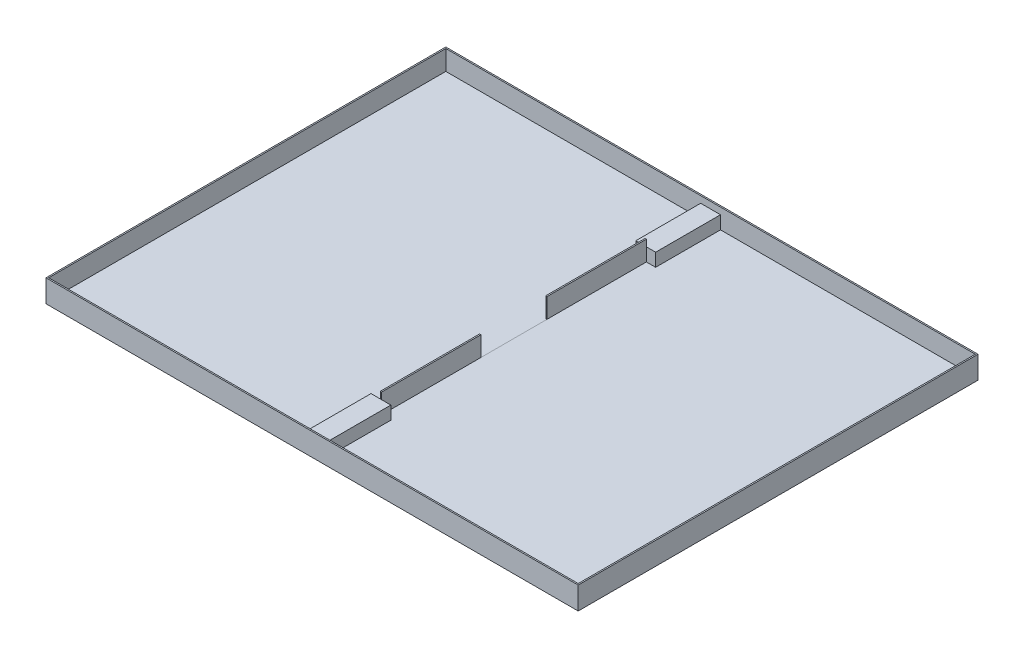
ISO-10303-21;
HEADER;
FILE_DESCRIPTION(('STEP AP214'),'2;1');
FILE_NAME('part.step','',(''),(''),'','','');
FILE_SCHEMA(('AUTOMOTIVE_DESIGN { 1 0 10303 214 1 1 1 1 }'));
ENDSEC;
DATA;
#1=APPLICATION_CONTEXT('core data for automotive mechanical design processes');
#2=APPLICATION_PROTOCOL_DEFINITION('international standard','automotive_design',2000,#1);
#3=PRODUCT_CONTEXT('',#1,'mechanical');
#4=PRODUCT('Part','Part','',(#3));
#5=PRODUCT_RELATED_PRODUCT_CATEGORY('part','',(#4));
#6=PRODUCT_DEFINITION_FORMATION('','',#4);
#7=PRODUCT_DEFINITION_CONTEXT('part definition',#1,'design');
#8=PRODUCT_DEFINITION('design','',#6,#7);
#9=PRODUCT_DEFINITION_SHAPE('','',#8);
#10=(LENGTH_UNIT() NAMED_UNIT(*) SI_UNIT(.MILLI.,.METRE.));
#11=(NAMED_UNIT(*) PLANE_ANGLE_UNIT() SI_UNIT($,.RADIAN.));
#12=(NAMED_UNIT(*) SI_UNIT($,.STERADIAN.) SOLID_ANGLE_UNIT());
#13=UNCERTAINTY_MEASURE_WITH_UNIT(LENGTH_MEASURE(1.E-05),#10,'distance_accuracy_value','');
#14=(GEOMETRIC_REPRESENTATION_CONTEXT(3) GLOBAL_UNCERTAINTY_ASSIGNED_CONTEXT((#13)) GLOBAL_UNIT_ASSIGNED_CONTEXT((#10,
#11,#12)) REPRESENTATION_CONTEXT('',''));
#15=CARTESIAN_POINT('',(0.,0.,0.));
#16=DIRECTION('',(0.,0.,1.));
#17=DIRECTION('',(1.,0.,0.));
#18=AXIS2_PLACEMENT_3D('',#15,#16,#17);
#19=CARTESIAN_POINT('',(3179.75343521253,-132.123275580284,3020.));
#20=DIRECTION('',(0.,-1.,0.));
#21=DIRECTION('',(0.,0.,-1.));
#22=AXIS2_PLACEMENT_3D('',#19,#20,#21);
#23=PLANE('',#22);
#24=DIRECTION('',(0.,0.,1.));
#25=VECTOR('',#24,1.);
#26=CARTESIAN_POINT('',(1174.75343521253,-132.123275580284,10.0000000000002));
#27=LINE('',#26,#25);
#28=CARTESIAN_POINT('',(1174.75343521253,-132.123275580284,1250.));
#29=VERTEX_POINT('',#28);
#30=CARTESIAN_POINT('',(1174.75343521253,-132.123275580284,1750.));
#31=VERTEX_POINT('',#30);
#32=EDGE_CURVE('E302',#29,#31,#27,.T.);
#33=ORIENTED_EDGE('',*,*,#32,.F.);
#34=DIRECTION('',(1.,0.,0.));
#35=VECTOR('',#34,1.);
#36=CARTESIAN_POINT('',(0.,-132.123275580284,1250.));
#37=LINE('',#36,#35);
#38=CARTESIAN_POINT('',(1164.75343521253,-132.123275580284,1250.));
#39=VERTEX_POINT('',#38);
#40=EDGE_CURVE('E409',#39,#29,#37,.T.);
#41=ORIENTED_EDGE('',*,*,#40,.F.);
#42=DIRECTION('',(0.,0.,1.));
#43=VECTOR('',#42,1.);
#44=CARTESIAN_POINT('',(1164.75343521253,-132.123275580284,0.));
#45=LINE('',#44,#43);
#46=CARTESIAN_POINT('',(1164.75343521253,-132.123275580284,500.));
#47=VERTEX_POINT('',#46);
#48=EDGE_CURVE('E404',#47,#39,#45,.T.);
#49=ORIENTED_EDGE('',*,*,#48,.F.);
#50=DIRECTION('',(1.,0.,0.));
#51=VECTOR('',#50,1.);
#52=CARTESIAN_POINT('',(1094.75343521253,-132.123275580284,500.));
#53=LINE('',#52,#51);
#54=CARTESIAN_POINT('',(1094.75343521253,-132.123275580284,500.));
#55=VERTEX_POINT('',#54);
#56=EDGE_CURVE('E338',#55,#47,#53,.T.);
#57=ORIENTED_EDGE('',*,*,#56,.F.);
#58=DIRECTION('',(0.,0.,1.));
#59=VECTOR('',#58,1.);
#60=CARTESIAN_POINT('',(1094.75343521253,-132.123275580284,10.));
#61=LINE('',#60,#59);
#62=CARTESIAN_POINT('',(1094.75343521253,-132.123275580284,10.));
#63=VERTEX_POINT('',#62);
#64=EDGE_CURVE('E274',#63,#55,#61,.T.);
#65=ORIENTED_EDGE('',*,*,#64,.F.);
#66=DIRECTION('',(1.,0.,0.));
#67=VECTOR('',#66,1.);
#68=CARTESIAN_POINT('',(0.,-132.123275580284,10.));
#69=LINE('',#68,#67);
#70=CARTESIAN_POINT('',(-830.246564787466,-132.123275580284,10.));
#71=VERTEX_POINT('',#70);
#72=EDGE_CURVE('E390',#71,#63,#69,.T.);
#73=ORIENTED_EDGE('',*,*,#72,.F.);
#74=DIRECTION('',(0.,0.,1.));
#75=VECTOR('',#74,1.);
#76=CARTESIAN_POINT('',(-830.246564787466,-132.123275580284,2.15077065546697E-13));
#77=LINE('',#76,#75);
#78=CARTESIAN_POINT('',(-830.246564787466,-132.123275580284,3010.));
#79=VERTEX_POINT('',#78);
#80=EDGE_CURVE('E362',#71,#79,#77,.T.);
#81=ORIENTED_EDGE('',*,*,#80,.T.);
#82=DIRECTION('',(1.,0.,0.));
#83=VECTOR('',#82,1.);
#84=CARTESIAN_POINT('',(0.,-132.123275580284,3010.));
#85=LINE('',#84,#83);
#86=CARTESIAN_POINT('',(1094.75343521253,-132.123275580284,3010.));
#87=VERTEX_POINT('',#86);
#88=EDGE_CURVE('E367',#79,#87,#85,.T.);
#89=ORIENTED_EDGE('',*,*,#88,.T.);
#90=DIRECTION('',(0.,0.,1.));
#91=VECTOR('',#90,1.);
#92=CARTESIAN_POINT('',(1094.75343521253,-132.123275580284,2500.));
#93=LINE('',#92,#91);
#94=CARTESIAN_POINT('',(1094.75343521253,-132.123275580284,2500.));
#95=VERTEX_POINT('',#94);
#96=EDGE_CURVE('E316',#95,#87,#93,.T.);
#97=ORIENTED_EDGE('',*,*,#96,.F.);
#98=DIRECTION('',(-1.,0.,0.));
#99=VECTOR('',#98,1.);
#100=CARTESIAN_POINT('',(1094.75343521253,-132.123275580284,2500.));
#101=LINE('',#100,#99);
#102=CARTESIAN_POINT('',(1164.75343521253,-132.123275580284,2500.));
#103=VERTEX_POINT('',#102);
#104=EDGE_CURVE('E312',#103,#95,#101,.T.);
#105=ORIENTED_EDGE('',*,*,#104,.F.);
#106=DIRECTION('',(0.,0.,1.));
#107=VECTOR('',#106,1.);
#108=CARTESIAN_POINT('',(1164.75343521253,-132.123275580284,0.));
#109=LINE('',#108,#107);
#110=CARTESIAN_POINT('',(1164.75343521253,-132.123275580284,1750.));
#111=VERTEX_POINT('',#110);
#112=EDGE_CURVE('E435',#111,#103,#109,.T.);
#113=ORIENTED_EDGE('',*,*,#112,.F.);
#114=DIRECTION('',(1.,0.,0.));
#115=VECTOR('',#114,1.);
#116=CARTESIAN_POINT('',(0.,-132.123275580284,1750.));
#117=LINE('',#116,#115);
#118=EDGE_CURVE('E430',#111,#31,#117,.T.);
#119=ORIENTED_EDGE('',*,*,#118,.T.);
#120=EDGE_LOOP('',(#33,#41,#49,#57,#65,#73,#81,#89,#97,#105,#113,#119));
#121=FACE_BOUND('',#120,.T.);
#122=ADVANCED_FACE('F84',(#121),#23,.F.);
#123=CARTESIAN_POINT('',(0.,17.8767244197162,3010.));
#124=DIRECTION('',(0.,0.,-1.));
#125=DIRECTION('',(-1.,0.,0.));
#126=AXIS2_PLACEMENT_3D('',#123,#124,#125);
#127=PLANE('',#126);
#128=DIRECTION('',(0.,-1.,0.));
#129=VECTOR('',#128,1.);
#130=CARTESIAN_POINT('',(3169.75343521253,17.8767244197165,3010.));
#131=LINE('',#130,#129);
#132=CARTESIAN_POINT('',(3169.75343521253,17.8767244197165,3010.));
#133=VERTEX_POINT('',#132);
#134=CARTESIAN_POINT('',(3169.75343521253,-131.123275580283,3010.));
#135=VERTEX_POINT('',#134);
#136=EDGE_CURVE('E396',#133,#135,#131,.T.);
#137=ORIENTED_EDGE('',*,*,#136,.T.);
#138=DIRECTION('',(1.,0.,0.));
#139=VECTOR('',#138,1.);
#140=CARTESIAN_POINT('',(3169.75343521253,-131.123275580283,3010.));
#141=LINE('',#140,#139);
#142=CARTESIAN_POINT('',(1244.75343521253,-131.123275580284,3010.));
#143=VERTEX_POINT('',#142);
#144=EDGE_CURVE('E285',#143,#135,#141,.T.);
#145=ORIENTED_EDGE('',*,*,#144,.F.);
#146=DIRECTION('',(0.,-1.,0.));
#147=VECTOR('',#146,1.);
#148=CARTESIAN_POINT('',(1244.75343521253,-32.1232755802837,3010.));
#149=LINE('',#148,#147);
#150=CARTESIAN_POINT('',(1244.75343521253,-32.1232755802837,3010.));
#151=VERTEX_POINT('',#150);
#152=EDGE_CURVE('E281',#151,#143,#149,.T.);
#153=ORIENTED_EDGE('',*,*,#152,.F.);
#154=DIRECTION('',(1.,0.,0.));
#155=VECTOR('',#154,1.);
#156=CARTESIAN_POINT('',(1094.75343521253,-32.1232755802837,3010.));
#157=LINE('',#156,#155);
#158=CARTESIAN_POINT('',(1094.75343521253,-32.1232755802837,3010.));
#159=VERTEX_POINT('',#158);
#160=EDGE_CURVE('E322',#159,#151,#157,.T.);
#161=ORIENTED_EDGE('',*,*,#160,.F.);
#162=DIRECTION('',(0.,-1.,0.));
#163=VECTOR('',#162,1.);
#164=CARTESIAN_POINT('',(1094.75343521253,-32.1232755802837,3010.));
#165=LINE('',#164,#163);
#166=EDGE_CURVE('E330',#159,#87,#165,.T.);
#167=ORIENTED_EDGE('',*,*,#166,.T.);
#168=ORIENTED_EDGE('',*,*,#88,.F.);
#169=DIRECTION('',(0.,-1.,0.));
#170=VECTOR('',#169,1.);
#171=CARTESIAN_POINT('',(-830.246564787466,17.8767244197161,3010.));
#172=LINE('',#171,#170);
#173=CARTESIAN_POINT('',(-830.246564787466,17.8767244197161,3010.));
#174=VERTEX_POINT('',#173);
#175=EDGE_CURVE('E387',#174,#79,#172,.T.);
#176=ORIENTED_EDGE('',*,*,#175,.F.);
#177=DIRECTION('',(1.,0.,0.));
#178=VECTOR('',#177,1.);
#179=CARTESIAN_POINT('',(0.,17.8767244197162,3010.));
#180=LINE('',#179,#178);
#181=EDGE_CURVE('E384',#174,#133,#180,.T.);
#182=ORIENTED_EDGE('',*,*,#181,.T.);
#183=EDGE_LOOP('',(#137,#145,#153,#161,#167,#168,#176,#182));
#184=FACE_BOUND('',#183,.T.);
#185=ADVANCED_FACE('F506',(#184),#127,.T.);
#186=CARTESIAN_POINT('',(0.,17.8767244197162,10.));
#187=DIRECTION('',(0.,0.,-1.));
#188=DIRECTION('',(-1.,0.,0.));
#189=AXIS2_PLACEMENT_3D('',#186,#187,#188);
#190=PLANE('',#189);
#191=DIRECTION('',(-1.,0.,0.));
#192=VECTOR('',#191,1.);
#193=CARTESIAN_POINT('',(3169.75343521253,-131.123275580283,10.));
#194=LINE('',#193,#192);
#195=CARTESIAN_POINT('',(3169.75343521253,-131.123275580283,10.));
#196=VERTEX_POINT('',#195);
#197=CARTESIAN_POINT('',(1244.75343521253,-131.123275580284,10.));
#198=VERTEX_POINT('',#197);
#199=EDGE_CURVE('E293',#196,#198,#194,.T.);
#200=ORIENTED_EDGE('',*,*,#199,.F.);
#201=DIRECTION('',(0.,-1.,0.));
#202=VECTOR('',#201,1.);
#203=CARTESIAN_POINT('',(3169.75343521253,17.8767244197165,10.));
#204=LINE('',#203,#202);
#205=CARTESIAN_POINT('',(3169.75343521253,17.8767244197165,10.));
#206=VERTEX_POINT('',#205);
#207=EDGE_CURVE('E399',#206,#196,#204,.T.);
#208=ORIENTED_EDGE('',*,*,#207,.F.);
#209=DIRECTION('',(1.,0.,0.));
#210=VECTOR('',#209,1.);
#211=CARTESIAN_POINT('',(0.,17.8767244197162,10.));
#212=LINE('',#211,#210);
#213=CARTESIAN_POINT('',(-830.246564787466,17.8767244197161,10.));
#214=VERTEX_POINT('',#213);
#215=EDGE_CURVE('E379',#214,#206,#212,.T.);
#216=ORIENTED_EDGE('',*,*,#215,.F.);
#217=DIRECTION('',(0.,-1.,0.));
#218=VECTOR('',#217,1.);
#219=CARTESIAN_POINT('',(-830.246564787466,17.8767244197161,10.));
#220=LINE('',#219,#218);
#221=EDGE_CURVE('E402',#214,#71,#220,.T.);
#222=ORIENTED_EDGE('',*,*,#221,.T.);
#223=ORIENTED_EDGE('',*,*,#72,.T.);
#224=DIRECTION('',(0.,-1.,0.));
#225=VECTOR('',#224,1.);
#226=CARTESIAN_POINT('',(1094.75343521253,-32.1232755802837,10.));
#227=LINE('',#226,#225);
#228=CARTESIAN_POINT('',(1094.75343521253,-32.1232755802837,10.));
#229=VERTEX_POINT('',#228);
#230=EDGE_CURVE('E355',#229,#63,#227,.T.);
#231=ORIENTED_EDGE('',*,*,#230,.F.);
#232=DIRECTION('',(-1.,0.,0.));
#233=VECTOR('',#232,1.);
#234=CARTESIAN_POINT('',(1094.75343521253,-32.1232755802837,10.));
#235=LINE('',#234,#233);
#236=CARTESIAN_POINT('',(1244.75343521253,-32.1232755802837,10.));
#237=VERTEX_POINT('',#236);
#238=EDGE_CURVE('E337',#237,#229,#235,.T.);
#239=ORIENTED_EDGE('',*,*,#238,.F.);
#240=DIRECTION('',(0.,-1.,0.));
#241=VECTOR('',#240,1.);
#242=CARTESIAN_POINT('',(1244.75343521253,-32.1232755802837,10.));
#243=LINE('',#242,#241);
#244=EDGE_CURVE('E357',#237,#198,#243,.T.);
#245=ORIENTED_EDGE('',*,*,#244,.T.);
#246=EDGE_LOOP('',(#200,#208,#216,#222,#223,#231,#239,#245));
#247=FACE_BOUND('',#246,.T.);
#248=ADVANCED_FACE('F511',(#247),#190,.F.);
#249=CARTESIAN_POINT('',(1174.75343521253,17.8767244197163,0.));
#250=DIRECTION('',(1.,0.,0.));
#251=DIRECTION('',(0.,1.,0.));
#252=AXIS2_PLACEMENT_3D('',#249,#250,#251);
#253=PLANE('',#252);
#254=DIRECTION('',(0.,-1.,0.));
#255=VECTOR('',#254,1.);
#256=CARTESIAN_POINT('',(1174.75343521253,17.8767244197163,2500.));
#257=LINE('',#256,#255);
#258=CARTESIAN_POINT('',(1174.75343521253,-32.1232755802837,2500.));
#259=VERTEX_POINT('',#258);
#260=CARTESIAN_POINT('',(1174.75343521253,-131.123275580284,2500.));
#261=VERTEX_POINT('',#260);
#262=EDGE_CURVE('E442',#259,#261,#257,.T.);
#263=ORIENTED_EDGE('',*,*,#262,.T.);
#264=DIRECTION('',(0.,0.,1.));
#265=VECTOR('',#264,1.);
#266=CARTESIAN_POINT('',(1174.75343521253,-131.123275580284,10.0000000000002));
#267=LINE('',#266,#265);
#268=CARTESIAN_POINT('',(1174.75343521253,-131.123275580284,1750.));
#269=VERTEX_POINT('',#268);
#270=EDGE_CURVE('E99',#269,#261,#267,.T.);
#271=ORIENTED_EDGE('',*,*,#270,.F.);
#272=DIRECTION('',(0.,-1.,0.));
#273=VECTOR('',#272,1.);
#274=CARTESIAN_POINT('',(1174.75343521253,17.8767244197163,1750.));
#275=LINE('',#274,#273);
#276=CARTESIAN_POINT('',(1174.75343521253,17.8767244197163,1750.));
#277=VERTEX_POINT('',#276);
#278=EDGE_CURVE('E457',#277,#269,#275,.T.);
#279=ORIENTED_EDGE('',*,*,#278,.F.);
#280=DIRECTION('',(0.,0.,1.));
#281=VECTOR('',#280,1.);
#282=CARTESIAN_POINT('',(1174.75343521253,17.8767244197163,0.));
#283=LINE('',#282,#281);
#284=CARTESIAN_POINT('',(1174.75343521253,17.8767244197163,2500.));
#285=VERTEX_POINT('',#284);
#286=EDGE_CURVE('E431',#277,#285,#283,.T.);
#287=ORIENTED_EDGE('',*,*,#286,.T.);
#288=EDGE_CURVE('E447',#285,#259,#257,.T.);
#289=ORIENTED_EDGE('',*,*,#288,.T.);
#290=EDGE_LOOP('',(#263,#271,#279,#287,#289));
#291=FACE_BOUND('',#290,.T.);
#292=ADVANCED_FACE('F527',(#291),#253,.T.);
#293=CARTESIAN_POINT('',(1174.75343521253,17.8767244197163,0.));
#294=DIRECTION('',(1.,0.,0.));
#295=DIRECTION('',(0.,1.,0.));
#296=AXIS2_PLACEMENT_3D('',#293,#294,#295);
#297=PLANE('',#296);
#298=DIRECTION('',(0.,-1.,0.));
#299=VECTOR('',#298,1.);
#300=CARTESIAN_POINT('',(1174.75343521253,17.8767244197163,1250.));
#301=LINE('',#300,#299);
#302=CARTESIAN_POINT('',(1174.75343521253,17.8767244197163,1250.));
#303=VERTEX_POINT('',#302);
#304=CARTESIAN_POINT('',(1174.75343521253,-131.123275580284,1250.));
#305=VERTEX_POINT('',#304);
#306=EDGE_CURVE('E422',#303,#305,#301,.T.);
#307=ORIENTED_EDGE('',*,*,#306,.T.);
#308=CARTESIAN_POINT('',(1174.75343521253,-131.123275580284,500.));
#309=VERTEX_POINT('',#308);
#310=EDGE_CURVE('E295',#309,#305,#267,.T.);
#311=ORIENTED_EDGE('',*,*,#310,.F.);
#312=DIRECTION('',(0.,-1.,0.));
#313=VECTOR('',#312,1.);
#314=CARTESIAN_POINT('',(1174.75343521253,17.8767244197163,500.));
#315=LINE('',#314,#313);
#316=CARTESIAN_POINT('',(1174.75343521253,-32.1232755802837,500.));
#317=VERTEX_POINT('',#316);
#318=EDGE_CURVE('E416',#317,#309,#315,.T.);
#319=ORIENTED_EDGE('',*,*,#318,.F.);
#320=CARTESIAN_POINT('',(1174.75343521253,17.8767244197163,500.));
#321=VERTEX_POINT('',#320);
#322=EDGE_CURVE('E419',#321,#317,#315,.T.);
#323=ORIENTED_EDGE('',*,*,#322,.F.);
#324=DIRECTION('',(0.,0.,1.));
#325=VECTOR('',#324,1.);
#326=CARTESIAN_POINT('',(1174.75343521253,17.8767244197163,0.));
#327=LINE('',#326,#325);
#328=EDGE_CURVE('E413',#321,#303,#327,.T.);
#329=ORIENTED_EDGE('',*,*,#328,.T.);
#330=EDGE_LOOP('',(#307,#311,#319,#323,#329));
#331=FACE_BOUND('',#330,.T.);
#332=ADVANCED_FACE('F566',(#331),#297,.T.);
#333=CARTESIAN_POINT('',(3169.75343521253,17.8767244197165,-4.69217766154352E-13));
#334=DIRECTION('',(1.,0.,0.));
#335=DIRECTION('',(0.,0.,-1.));
#336=AXIS2_PLACEMENT_3D('',#333,#334,#335);
#337=PLANE('',#336);
#338=DIRECTION('',(0.,0.,-1.));
#339=VECTOR('',#338,1.);
#340=CARTESIAN_POINT('',(3169.75343521253,-131.123275580283,10.));
#341=LINE('',#340,#339);
#342=EDGE_CURVE('E296',#135,#196,#341,.T.);
#343=ORIENTED_EDGE('',*,*,#342,.F.);
#344=ORIENTED_EDGE('',*,*,#136,.F.);
#345=DIRECTION('',(0.,0.,1.));
#346=VECTOR('',#345,1.);
#347=CARTESIAN_POINT('',(3169.75343521253,17.8767244197165,-4.69217766154352E-13));
#348=LINE('',#347,#346);
#349=EDGE_CURVE('E382',#206,#133,#348,.T.);
#350=ORIENTED_EDGE('',*,*,#349,.F.);
#351=ORIENTED_EDGE('',*,*,#207,.T.);
#352=EDGE_LOOP('',(#343,#344,#350,#351));
#353=FACE_BOUND('',#352,.T.);
#354=ADVANCED_FACE('F545',(#353),#337,.F.);
#355=CARTESIAN_POINT('',(1244.75343521253,-32.1232755802837,10.));
#356=DIRECTION('',(-1.,0.,0.));
#357=DIRECTION('',(0.,-1.,0.));
#358=AXIS2_PLACEMENT_3D('',#355,#356,#357);
#359=PLANE('',#358);
#360=DIRECTION('',(0.,0.,1.));
#361=VECTOR('',#360,1.);
#362=CARTESIAN_POINT('',(1244.75343521253,-131.123275580284,10.));
#363=LINE('',#362,#361);
#364=CARTESIAN_POINT('',(1244.75343521253,-131.123275580284,500.));
#365=VERTEX_POINT('',#364);
#366=EDGE_CURVE('E306',#198,#365,#363,.T.);
#367=ORIENTED_EDGE('',*,*,#366,.F.);
#368=ORIENTED_EDGE('',*,*,#244,.F.);
#369=DIRECTION('',(0.,0.,-1.));
#370=VECTOR('',#369,1.);
#371=CARTESIAN_POINT('',(1244.75343521253,-32.1232755802837,10.));
#372=LINE('',#371,#370);
#373=CARTESIAN_POINT('',(1244.75343521253,-32.1232755802837,500.));
#374=VERTEX_POINT('',#373);
#375=EDGE_CURVE('E334',#374,#237,#372,.T.);
#376=ORIENTED_EDGE('',*,*,#375,.F.);
#377=DIRECTION('',(0.,-1.,0.));
#378=VECTOR('',#377,1.);
#379=CARTESIAN_POINT('',(1244.75343521253,-32.1232755802837,500.));
#380=LINE('',#379,#378);
#381=EDGE_CURVE('E346',#374,#365,#380,.T.);
#382=ORIENTED_EDGE('',*,*,#381,.T.);
#383=EDGE_LOOP('',(#367,#368,#376,#382));
#384=FACE_BOUND('',#383,.T.);
#385=ADVANCED_FACE('F554',(#384),#359,.F.);
#386=CARTESIAN_POINT('',(1094.75343521253,-32.1232755802837,500.));
#387=DIRECTION('',(0.,0.,-1.));
#388=DIRECTION('',(-1.,0.,0.));
#389=AXIS2_PLACEMENT_3D('',#386,#387,#388);
#390=PLANE('',#389);
#391=DIRECTION('',(-1.,0.,0.));
#392=VECTOR('',#391,1.);
#393=CARTESIAN_POINT('',(1094.75343521253,-131.123275580284,500.));
#394=LINE('',#393,#392);
#395=EDGE_CURVE('E284',#365,#309,#394,.T.);
#396=ORIENTED_EDGE('',*,*,#395,.F.);
#397=ORIENTED_EDGE('',*,*,#381,.F.);
#398=DIRECTION('',(1.,0.,0.));
#399=VECTOR('',#398,1.);
#400=CARTESIAN_POINT('',(1094.75343521253,-32.1232755802837,500.));
#401=LINE('',#400,#399);
#402=EDGE_CURVE('E342',#317,#374,#401,.T.);
#403=ORIENTED_EDGE('',*,*,#402,.F.);
#404=ORIENTED_EDGE('',*,*,#318,.T.);
#405=EDGE_LOOP('',(#396,#397,#403,#404));
#406=FACE_BOUND('',#405,.T.);
#407=ADVANCED_FACE('F564',(#406),#390,.F.);
#408=CARTESIAN_POINT('',(1244.75343521253,-32.1232755802837,2500.));
#409=DIRECTION('',(-1.,0.,0.));
#410=DIRECTION('',(0.,-1.,0.));
#411=AXIS2_PLACEMENT_3D('',#408,#409,#410);
#412=PLANE('',#411);
#413=DIRECTION('',(0.,0.,1.));
#414=VECTOR('',#413,1.);
#415=CARTESIAN_POINT('',(1244.75343521253,-131.123275580284,2500.));
#416=LINE('',#415,#414);
#417=CARTESIAN_POINT('',(1244.75343521253,-131.123275580284,2500.));
#418=VERTEX_POINT('',#417);
#419=EDGE_CURVE('E279',#418,#143,#416,.T.);
#420=ORIENTED_EDGE('',*,*,#419,.F.);
#421=DIRECTION('',(0.,-1.,0.));
#422=VECTOR('',#421,1.);
#423=CARTESIAN_POINT('',(1244.75343521253,-32.1232755802837,2500.));
#424=LINE('',#423,#422);
#425=CARTESIAN_POINT('',(1244.75343521253,-32.1232755802837,2500.));
#426=VERTEX_POINT('',#425);
#427=EDGE_CURVE('E265',#426,#418,#424,.T.);
#428=ORIENTED_EDGE('',*,*,#427,.F.);
#429=DIRECTION('',(0.,0.,-1.));
#430=VECTOR('',#429,1.);
#431=CARTESIAN_POINT('',(1244.75343521253,-32.1232755802837,2500.));
#432=LINE('',#431,#430);
#433=EDGE_CURVE('E313',#151,#426,#432,.T.);
#434=ORIENTED_EDGE('',*,*,#433,.F.);
#435=ORIENTED_EDGE('',*,*,#152,.T.);
#436=EDGE_LOOP('',(#420,#428,#434,#435));
#437=FACE_BOUND('',#436,.T.);
#438=ADVANCED_FACE('F280',(#437),#412,.F.);
#439=CARTESIAN_POINT('',(1094.75343521253,-32.1232755802837,2500.));
#440=DIRECTION('',(0.,0.,1.));
#441=DIRECTION('',(1.,0.,0.));
#442=AXIS2_PLACEMENT_3D('',#439,#440,#441);
#443=PLANE('',#442);
#444=DIRECTION('',(1.,0.,0.));
#445=VECTOR('',#444,1.);
#446=CARTESIAN_POINT('',(1094.75343521253,-131.123275580284,2500.));
#447=LINE('',#446,#445);
#448=EDGE_CURVE('E12',#261,#418,#447,.T.);
#449=ORIENTED_EDGE('',*,*,#448,.F.);
#450=ORIENTED_EDGE('',*,*,#262,.F.);
#451=DIRECTION('',(-1.,0.,0.));
#452=VECTOR('',#451,1.);
#453=CARTESIAN_POINT('',(1094.75343521253,-32.1232755802837,2500.));
#454=LINE('',#453,#452);
#455=EDGE_CURVE('E270',#426,#259,#454,.T.);
#456=ORIENTED_EDGE('',*,*,#455,.F.);
#457=ORIENTED_EDGE('',*,*,#427,.T.);
#458=EDGE_LOOP('',(#449,#450,#456,#457));
#459=FACE_BOUND('',#458,.T.);
#460=ADVANCED_FACE('F267',(#459),#443,.F.);
#461=CARTESIAN_POINT('',(0.,17.8767244197162,1750.));
#462=DIRECTION('',(0.,0.,-1.));
#463=DIRECTION('',(-1.,0.,0.));
#464=AXIS2_PLACEMENT_3D('',#461,#462,#463);
#465=PLANE('',#464);
#466=ORIENTED_EDGE('',*,*,#118,.F.);
#467=DIRECTION('',(0.,-1.,0.));
#468=VECTOR('',#467,1.);
#469=CARTESIAN_POINT('',(1164.75343521253,17.8767244197163,1750.));
#470=LINE('',#469,#468);
#471=CARTESIAN_POINT('',(1164.75343521253,17.8767244197163,1750.));
#472=VERTEX_POINT('',#471);
#473=EDGE_CURVE('E454',#472,#111,#470,.T.);
#474=ORIENTED_EDGE('',*,*,#473,.F.);
#475=DIRECTION('',(1.,0.,0.));
#476=VECTOR('',#475,1.);
#477=CARTESIAN_POINT('',(0.,17.8767244197162,1750.));
#478=LINE('',#477,#476);
#479=EDGE_CURVE('E434',#472,#277,#478,.T.);
#480=ORIENTED_EDGE('',*,*,#479,.T.);
#481=ORIENTED_EDGE('',*,*,#278,.T.);
#482=DIRECTION('',(0.,-1.,0.));
#483=VECTOR('',#482,1.);
#484=CARTESIAN_POINT('',(1174.75343521253,17.8767244197163,1750.));
#485=LINE('',#484,#483);
#486=EDGE_CURVE('E310',#269,#31,#485,.T.);
#487=ORIENTED_EDGE('',*,*,#486,.T.);
#488=EDGE_LOOP('',(#466,#474,#480,#481,#487));
#489=FACE_BOUND('',#488,.T.);
#490=ADVANCED_FACE('F524',(#489),#465,.T.);
#491=CARTESIAN_POINT('',(1164.75343521253,17.8767244197163,0.));
#492=DIRECTION('',(1.,0.,0.));
#493=DIRECTION('',(0.,1.,0.));
#494=AXIS2_PLACEMENT_3D('',#491,#492,#493);
#495=PLANE('',#494);
#496=ORIENTED_EDGE('',*,*,#112,.T.);
#497=DIRECTION('',(0.,-1.,0.));
#498=VECTOR('',#497,1.);
#499=CARTESIAN_POINT('',(1164.75343521253,17.8767244197163,2500.));
#500=LINE('',#499,#498);
#501=CARTESIAN_POINT('',(1164.75343521253,-32.1232755802837,2500.));
#502=VERTEX_POINT('',#501);
#503=EDGE_CURVE('E450',#502,#103,#500,.T.);
#504=ORIENTED_EDGE('',*,*,#503,.F.);
#505=CARTESIAN_POINT('',(1164.75343521253,17.8767244197163,2500.));
#506=VERTEX_POINT('',#505);
#507=EDGE_CURVE('E451',#506,#502,#500,.T.);
#508=ORIENTED_EDGE('',*,*,#507,.F.);
#509=DIRECTION('',(0.,0.,1.));
#510=VECTOR('',#509,1.);
#511=CARTESIAN_POINT('',(1164.75343521253,17.8767244197163,0.));
#512=LINE('',#511,#510);
#513=EDGE_CURVE('E438',#472,#506,#512,.T.);
#514=ORIENTED_EDGE('',*,*,#513,.F.);
#515=ORIENTED_EDGE('',*,*,#473,.T.);
#516=EDGE_LOOP('',(#496,#504,#508,#514,#515));
#517=FACE_BOUND('',#516,.T.);
#518=ADVANCED_FACE('F617',(#517),#495,.F.);
#519=CARTESIAN_POINT('',(0.,17.8767244197162,2500.));
#520=DIRECTION('',(0.,0.,-1.));
#521=DIRECTION('',(-1.,0.,0.));
#522=AXIS2_PLACEMENT_3D('',#519,#520,#521);
#523=PLANE('',#522);
#524=ORIENTED_EDGE('',*,*,#507,.T.);
#525=EDGE_CURVE('E319',#259,#502,#454,.T.);
#526=ORIENTED_EDGE('',*,*,#525,.F.);
#527=ORIENTED_EDGE('',*,*,#288,.F.);
#528=DIRECTION('',(1.,0.,0.));
#529=VECTOR('',#528,1.);
#530=CARTESIAN_POINT('',(0.,17.8767244197162,2500.));
#531=LINE('',#530,#529);
#532=EDGE_CURVE('E440',#506,#285,#531,.T.);
#533=ORIENTED_EDGE('',*,*,#532,.F.);
#534=EDGE_LOOP('',(#524,#526,#527,#533));
#535=FACE_BOUND('',#534,.T.);
#536=ADVANCED_FACE('F535',(#535),#523,.F.);
#537=CARTESIAN_POINT('',(0.,17.8767244197162,0.));
#538=DIRECTION('',(0.,1.,0.));
#539=DIRECTION('',(-1.,0.,0.));
#540=AXIS2_PLACEMENT_3D('',#537,#538,#539);
#541=PLANE('',#540);
#542=ORIENTED_EDGE('',*,*,#286,.F.);
#543=ORIENTED_EDGE('',*,*,#479,.F.);
#544=ORIENTED_EDGE('',*,*,#513,.T.);
#545=ORIENTED_EDGE('',*,*,#532,.T.);
#546=EDGE_LOOP('',(#542,#543,#544,#545));
#547=FACE_BOUND('',#546,.T.);
#548=ADVANCED_FACE('F529',(#547),#541,.T.);
#549=CARTESIAN_POINT('',(0.,17.8767244197162,500.));
#550=DIRECTION('',(0.,0.,-1.));
#551=DIRECTION('',(-1.,0.,0.));
#552=AXIS2_PLACEMENT_3D('',#549,#550,#551);
#553=PLANE('',#552);
#554=CARTESIAN_POINT('',(1164.75343521253,-32.1232755802837,500.));
#555=VERTEX_POINT('',#554);
#556=EDGE_CURVE('E347',#555,#317,#401,.T.);
#557=ORIENTED_EDGE('',*,*,#556,.F.);
#558=DIRECTION('',(0.,-1.,0.));
#559=VECTOR('',#558,1.);
#560=CARTESIAN_POINT('',(1164.75343521253,17.8767244197163,500.));
#561=LINE('',#560,#559);
#562=CARTESIAN_POINT('',(1164.75343521253,17.8767244197163,500.));
#563=VERTEX_POINT('',#562);
#564=EDGE_CURVE('E427',#563,#555,#561,.T.);
#565=ORIENTED_EDGE('',*,*,#564,.F.);
#566=DIRECTION('',(1.,0.,0.));
#567=VECTOR('',#566,1.);
#568=CARTESIAN_POINT('',(0.,17.8767244197162,500.));
#569=LINE('',#568,#567);
#570=EDGE_CURVE('E405',#563,#321,#569,.T.);
#571=ORIENTED_EDGE('',*,*,#570,.T.);
#572=ORIENTED_EDGE('',*,*,#322,.T.);
#573=EDGE_LOOP('',(#557,#565,#571,#572));
#574=FACE_BOUND('',#573,.T.);
#575=ADVANCED_FACE('F568',(#574),#553,.T.);
#576=CARTESIAN_POINT('',(1164.75343521253,17.8767244197163,0.));
#577=DIRECTION('',(1.,0.,0.));
#578=DIRECTION('',(0.,1.,0.));
#579=AXIS2_PLACEMENT_3D('',#576,#577,#578);
#580=PLANE('',#579);
#581=ORIENTED_EDGE('',*,*,#48,.T.);
#582=DIRECTION('',(0.,-1.,0.));
#583=VECTOR('',#582,1.);
#584=CARTESIAN_POINT('',(1164.75343521253,17.8767244197163,1250.));
#585=LINE('',#584,#583);
#586=CARTESIAN_POINT('',(1164.75343521253,17.8767244197163,1250.));
#587=VERTEX_POINT('',#586);
#588=EDGE_CURVE('E424',#587,#39,#585,.T.);
#589=ORIENTED_EDGE('',*,*,#588,.F.);
#590=DIRECTION('',(0.,0.,1.));
#591=VECTOR('',#590,1.);
#592=CARTESIAN_POINT('',(1164.75343521253,17.8767244197163,0.));
#593=LINE('',#592,#591);
#594=EDGE_CURVE('E408',#563,#587,#593,.T.);
#595=ORIENTED_EDGE('',*,*,#594,.F.);
#596=ORIENTED_EDGE('',*,*,#564,.T.);
#597=DIRECTION('',(0.,1.,0.));
#598=VECTOR('',#597,1.);
#599=CARTESIAN_POINT('',(1164.75343521253,17.8767244197163,500.));
#600=LINE('',#599,#598);
#601=EDGE_CURVE('E360',#47,#555,#600,.T.);
#602=ORIENTED_EDGE('',*,*,#601,.F.);
#603=EDGE_LOOP('',(#581,#589,#595,#596,#602));
#604=FACE_BOUND('',#603,.T.);
#605=ADVANCED_FACE('F575',(#604),#580,.F.);
#606=CARTESIAN_POINT('',(0.,17.8767244197162,1250.));
#607=DIRECTION('',(0.,0.,-1.));
#608=DIRECTION('',(-1.,0.,0.));
#609=AXIS2_PLACEMENT_3D('',#606,#607,#608);
#610=PLANE('',#609);
#611=ORIENTED_EDGE('',*,*,#40,.T.);
#612=DIRECTION('',(0.,-1.,0.));
#613=VECTOR('',#612,1.);
#614=CARTESIAN_POINT('',(1174.75343521253,17.8767244197163,1250.));
#615=LINE('',#614,#613);
#616=EDGE_CURVE('E107',#305,#29,#615,.T.);
#617=ORIENTED_EDGE('',*,*,#616,.F.);
#618=ORIENTED_EDGE('',*,*,#306,.F.);
#619=DIRECTION('',(1.,0.,0.));
#620=VECTOR('',#619,1.);
#621=CARTESIAN_POINT('',(0.,17.8767244197162,1250.));
#622=LINE('',#621,#620);
#623=EDGE_CURVE('E411',#587,#303,#622,.T.);
#624=ORIENTED_EDGE('',*,*,#623,.F.);
#625=ORIENTED_EDGE('',*,*,#588,.T.);
#626=EDGE_LOOP('',(#611,#617,#618,#624,#625));
#627=FACE_BOUND('',#626,.T.);
#628=ADVANCED_FACE('F519',(#627),#610,.F.);
#629=CARTESIAN_POINT('',(0.,17.8767244197162,0.));
#630=DIRECTION('',(0.,1.,0.));
#631=DIRECTION('',(-1.,0.,0.));
#632=AXIS2_PLACEMENT_3D('',#629,#630,#631);
#633=PLANE('',#632);
#634=ORIENTED_EDGE('',*,*,#570,.F.);
#635=ORIENTED_EDGE('',*,*,#594,.T.);
#636=ORIENTED_EDGE('',*,*,#623,.T.);
#637=ORIENTED_EDGE('',*,*,#328,.F.);
#638=EDGE_LOOP('',(#634,#635,#636,#637));
#639=FACE_BOUND('',#638,.T.);
#640=ADVANCED_FACE('F573',(#639),#633,.T.);
#641=CARTESIAN_POINT('',(-830.246564787466,17.8767244197161,2.15077065546697E-13));
#642=DIRECTION('',(1.,0.,0.));
#643=DIRECTION('',(0.,0.,-1.));
#644=AXIS2_PLACEMENT_3D('',#641,#642,#643);
#645=PLANE('',#644);
#646=ORIENTED_EDGE('',*,*,#80,.F.);
#647=ORIENTED_EDGE('',*,*,#221,.F.);
#648=DIRECTION('',(0.,0.,1.));
#649=VECTOR('',#648,1.);
#650=CARTESIAN_POINT('',(-830.246564787466,17.8767244197161,2.15077065546697E-13));
#651=LINE('',#650,#649);
#652=EDGE_CURVE('E376',#214,#174,#651,.T.);
#653=ORIENTED_EDGE('',*,*,#652,.T.);
#654=ORIENTED_EDGE('',*,*,#175,.T.);
#655=EDGE_LOOP('',(#646,#647,#653,#654));
#656=FACE_BOUND('',#655,.T.);
#657=ADVANCED_FACE('F587',(#656),#645,.T.);
#658=CARTESIAN_POINT('',(0.,17.8767244197162,0.));
#659=DIRECTION('',(0.,1.,0.));
#660=DIRECTION('',(-1.,0.,0.));
#661=AXIS2_PLACEMENT_3D('',#658,#659,#660);
#662=PLANE('',#661);
#663=DIRECTION('',(0.,0.,-1.));
#664=VECTOR('',#663,1.);
#665=CARTESIAN_POINT('',(3179.75343521253,17.8767244197165,0.));
#666=LINE('',#665,#664);
#667=CARTESIAN_POINT('',(3179.75343521253,17.8767244197165,3020.));
#668=VERTEX_POINT('',#667);
#669=CARTESIAN_POINT('',(3179.75343521253,17.8767244197165,0.));
#670=VERTEX_POINT('',#669);
#671=EDGE_CURVE('E363',#668,#670,#666,.T.);
#672=ORIENTED_EDGE('',*,*,#671,.T.);
#673=DIRECTION('',(-1.,0.,0.));
#674=VECTOR('',#673,1.);
#675=CARTESIAN_POINT('',(0.,17.8767244197162,0.));
#676=LINE('',#675,#674);
#677=CARTESIAN_POINT('',(-840.246564787466,17.8767244197161,0.));
#678=VERTEX_POINT('',#677);
#679=EDGE_CURVE('E366',#670,#678,#676,.T.);
#680=ORIENTED_EDGE('',*,*,#679,.T.);
#681=DIRECTION('',(0.,0.,1.));
#682=VECTOR('',#681,1.);
#683=CARTESIAN_POINT('',(-840.246564787466,17.8767244197161,0.));
#684=LINE('',#683,#682);
#685=CARTESIAN_POINT('',(-840.246564787466,17.8767244197161,3020.));
#686=VERTEX_POINT('',#685);
#687=EDGE_CURVE('E370',#678,#686,#684,.T.);
#688=ORIENTED_EDGE('',*,*,#687,.T.);
#689=DIRECTION('',(1.,0.,0.));
#690=VECTOR('',#689,1.);
#691=CARTESIAN_POINT('',(0.,17.8767244197162,3020.));
#692=LINE('',#691,#690);
#693=EDGE_CURVE('E373',#686,#668,#692,.T.);
#694=ORIENTED_EDGE('',*,*,#693,.T.);
#695=EDGE_LOOP('',(#672,#680,#688,#694));
#696=FACE_BOUND('',#695,.T.);
#697=ORIENTED_EDGE('',*,*,#652,.F.);
#698=ORIENTED_EDGE('',*,*,#215,.T.);
#699=ORIENTED_EDGE('',*,*,#349,.T.);
#700=ORIENTED_EDGE('',*,*,#181,.F.);
#701=EDGE_LOOP('',(#697,#698,#699,#700));
#702=FACE_BOUND('',#701,.T.);
#703=ADVANCED_FACE('F492',(#696,#702),#662,.T.);
#704=CARTESIAN_POINT('',(-840.246564787466,-152.123275580284,3020.));
#705=DIRECTION('',(0.,1.,0.));
#706=DIRECTION('',(0.,0.,1.));
#707=AXIS2_PLACEMENT_3D('',#704,#705,#706);
#708=PLANE('',#707);
#709=DIRECTION('',(1.,0.,0.));
#710=VECTOR('',#709,1.);
#711=CARTESIAN_POINT('',(-840.246564787466,-152.123275580284,0.));
#712=LINE('',#711,#710);
#713=CARTESIAN_POINT('',(-840.246564787466,-152.123275580284,0.));
#714=VERTEX_POINT('',#713);
#715=CARTESIAN_POINT('',(3179.75343521253,-152.123275580284,0.));
#716=VERTEX_POINT('',#715);
#717=EDGE_CURVE('E463',#714,#716,#712,.T.);
#718=ORIENTED_EDGE('',*,*,#717,.T.);
#719=DIRECTION('',(0.,0.,-1.));
#720=VECTOR('',#719,1.);
#721=CARTESIAN_POINT('',(3179.75343521253,-152.123275580284,3020.));
#722=LINE('',#721,#720);
#723=CARTESIAN_POINT('',(3179.75343521253,-152.123275580284,3020.));
#724=VERTEX_POINT('',#723);
#725=EDGE_CURVE('E467',#724,#716,#722,.T.);
#726=ORIENTED_EDGE('',*,*,#725,.F.);
#727=DIRECTION('',(1.,0.,0.));
#728=VECTOR('',#727,1.);
#729=CARTESIAN_POINT('',(-840.246564787466,-152.123275580284,3020.));
#730=LINE('',#729,#728);
#731=CARTESIAN_POINT('',(-840.246564787466,-152.123275580284,3020.));
#732=VERTEX_POINT('',#731);
#733=EDGE_CURVE('E465',#732,#724,#730,.T.);
#734=ORIENTED_EDGE('',*,*,#733,.F.);
#735=DIRECTION('',(0.,0.,-1.));
#736=VECTOR('',#735,1.);
#737=CARTESIAN_POINT('',(-840.246564787466,-152.123275580284,3020.));
#738=LINE('',#737,#736);
#739=EDGE_CURVE('E92',#732,#714,#738,.T.);
#740=ORIENTED_EDGE('',*,*,#739,.T.);
#741=EDGE_LOOP('',(#718,#726,#734,#740));
#742=FACE_BOUND('',#741,.T.);
#743=ADVANCED_FACE('F478',(#742),#708,.F.);
#744=CARTESIAN_POINT('',(0.,0.,3020.));
#745=DIRECTION('',(0.,0.,1.));
#746=DIRECTION('',(1.,0.,0.));
#747=AXIS2_PLACEMENT_3D('',#744,#745,#746);
#748=PLANE('',#747);
#749=DIRECTION('',(0.,1.,0.));
#750=VECTOR('',#749,1.);
#751=CARTESIAN_POINT('',(3179.75343521253,-152.123275580284,3020.));
#752=LINE('',#751,#750);
#753=EDGE_CURVE('E460',#724,#668,#752,.T.);
#754=ORIENTED_EDGE('',*,*,#753,.T.);
#755=ORIENTED_EDGE('',*,*,#693,.F.);
#756=DIRECTION('',(0.,-1.,0.));
#757=VECTOR('',#756,1.);
#758=CARTESIAN_POINT('',(-840.246564787466,-132.123275580284,3020.));
#759=LINE('',#758,#757);
#760=EDGE_CURVE('E462',#686,#732,#759,.T.);
#761=ORIENTED_EDGE('',*,*,#760,.T.);
#762=ORIENTED_EDGE('',*,*,#733,.T.);
#763=EDGE_LOOP('',(#754,#755,#761,#762));
#764=FACE_BOUND('',#763,.T.);
#765=ADVANCED_FACE('F490',(#764),#748,.T.);
#766=CARTESIAN_POINT('',(0.,0.,0.));
#767=DIRECTION('',(0.,0.,1.));
#768=DIRECTION('',(1.,0.,0.));
#769=AXIS2_PLACEMENT_3D('',#766,#767,#768);
#770=PLANE('',#769);
#771=DIRECTION('',(0.,1.,0.));
#772=VECTOR('',#771,1.);
#773=CARTESIAN_POINT('',(3179.75343521253,-152.123275580284,0.));
#774=LINE('',#773,#772);
#775=EDGE_CURVE('E459',#716,#670,#774,.T.);
#776=ORIENTED_EDGE('',*,*,#775,.F.);
#777=ORIENTED_EDGE('',*,*,#717,.F.);
#778=DIRECTION('',(0.,-1.,0.));
#779=VECTOR('',#778,1.);
#780=CARTESIAN_POINT('',(-840.246564787466,-132.123275580284,0.));
#781=LINE('',#780,#779);
#782=EDGE_CURVE('E469',#678,#714,#781,.T.);
#783=ORIENTED_EDGE('',*,*,#782,.F.);
#784=ORIENTED_EDGE('',*,*,#679,.F.);
#785=EDGE_LOOP('',(#776,#777,#783,#784));
#786=FACE_BOUND('',#785,.T.);
#787=ADVANCED_FACE('F483',(#786),#770,.F.);
#788=CARTESIAN_POINT('',(-840.246564787466,-132.123275580284,3020.));
#789=DIRECTION('',(1.,0.,0.));
#790=DIRECTION('',(0.,0.,-1.));
#791=AXIS2_PLACEMENT_3D('',#788,#789,#790);
#792=PLANE('',#791);
#793=ORIENTED_EDGE('',*,*,#782,.T.);
#794=ORIENTED_EDGE('',*,*,#739,.F.);
#795=ORIENTED_EDGE('',*,*,#760,.F.);
#796=ORIENTED_EDGE('',*,*,#687,.F.);
#797=EDGE_LOOP('',(#793,#794,#795,#796));
#798=FACE_BOUND('',#797,.T.);
#799=ADVANCED_FACE('F495',(#798),#792,.F.);
#800=CARTESIAN_POINT('',(3179.75343521253,-152.123275580284,3020.));
#801=DIRECTION('',(-1.,0.,0.));
#802=DIRECTION('',(0.,0.,1.));
#803=AXIS2_PLACEMENT_3D('',#800,#801,#802);
#804=PLANE('',#803);
#805=ORIENTED_EDGE('',*,*,#775,.T.);
#806=ORIENTED_EDGE('',*,*,#671,.F.);
#807=ORIENTED_EDGE('',*,*,#753,.F.);
#808=ORIENTED_EDGE('',*,*,#725,.T.);
#809=EDGE_LOOP('',(#805,#806,#807,#808));
#810=FACE_BOUND('',#809,.T.);
#811=ADVANCED_FACE('F86',(#810),#804,.F.);
#812=ORIENTED_EDGE('',*,*,#56,.T.);
#813=ORIENTED_EDGE('',*,*,#601,.T.);
#814=CARTESIAN_POINT('',(1094.75343521253,-32.1232755802837,500.));
#815=VERTEX_POINT('',#814);
#816=EDGE_CURVE('E343',#815,#555,#401,.T.);
#817=ORIENTED_EDGE('',*,*,#816,.F.);
#818=DIRECTION('',(0.,-1.,0.));
#819=VECTOR('',#818,1.);
#820=CARTESIAN_POINT('',(1094.75343521253,-32.1232755802837,500.));
#821=LINE('',#820,#819);
#822=EDGE_CURVE('E352',#815,#55,#821,.T.);
#823=ORIENTED_EDGE('',*,*,#822,.T.);
#824=EDGE_LOOP('',(#812,#813,#817,#823));
#825=FACE_BOUND('',#824,.T.);
#826=ADVANCED_FACE('F502',(#825),#390,.F.);
#827=CARTESIAN_POINT('',(1094.75343521253,-32.1232755802837,10.));
#828=DIRECTION('',(1.,0.,0.));
#829=DIRECTION('',(0.,1.,0.));
#830=AXIS2_PLACEMENT_3D('',#827,#828,#829);
#831=PLANE('',#830);
#832=ORIENTED_EDGE('',*,*,#64,.T.);
#833=ORIENTED_EDGE('',*,*,#822,.F.);
#834=DIRECTION('',(0.,0.,1.));
#835=VECTOR('',#834,1.);
#836=CARTESIAN_POINT('',(1094.75343521253,-32.1232755802837,10.));
#837=LINE('',#836,#835);
#838=EDGE_CURVE('E340',#229,#815,#837,.T.);
#839=ORIENTED_EDGE('',*,*,#838,.F.);
#840=ORIENTED_EDGE('',*,*,#230,.T.);
#841=EDGE_LOOP('',(#832,#833,#839,#840));
#842=FACE_BOUND('',#841,.T.);
#843=ADVANCED_FACE('F584',(#842),#831,.F.);
#844=CARTESIAN_POINT('',(0.,-32.1232755802837,0.));
#845=DIRECTION('',(0.,1.,0.));
#846=DIRECTION('',(0.,0.,1.));
#847=AXIS2_PLACEMENT_3D('',#844,#845,#846);
#848=PLANE('',#847);
#849=ORIENTED_EDGE('',*,*,#375,.T.);
#850=ORIENTED_EDGE('',*,*,#238,.T.);
#851=ORIENTED_EDGE('',*,*,#838,.T.);
#852=ORIENTED_EDGE('',*,*,#816,.T.);
#853=ORIENTED_EDGE('',*,*,#556,.T.);
#854=ORIENTED_EDGE('',*,*,#402,.T.);
#855=EDGE_LOOP('',(#849,#850,#851,#852,#853,#854));
#856=FACE_BOUND('',#855,.T.);
#857=ADVANCED_FACE('F556',(#856),#848,.T.);
#858=CARTESIAN_POINT('',(1094.75343521253,-32.1232755802837,2500.));
#859=VERTEX_POINT('',#858);
#860=EDGE_CURVE('E315',#502,#859,#454,.T.);
#861=ORIENTED_EDGE('',*,*,#860,.F.);
#862=ORIENTED_EDGE('',*,*,#503,.T.);
#863=ORIENTED_EDGE('',*,*,#104,.T.);
#864=DIRECTION('',(0.,-1.,0.));
#865=VECTOR('',#864,1.);
#866=CARTESIAN_POINT('',(1094.75343521253,-32.1232755802837,2500.));
#867=LINE('',#866,#865);
#868=EDGE_CURVE('E275',#859,#95,#867,.T.);
#869=ORIENTED_EDGE('',*,*,#868,.F.);
#870=EDGE_LOOP('',(#861,#862,#863,#869));
#871=FACE_BOUND('',#870,.T.);
#872=ADVANCED_FACE('F698',(#871),#443,.F.);
#873=CARTESIAN_POINT('',(1094.75343521253,-32.1232755802837,2500.));
#874=DIRECTION('',(1.,0.,0.));
#875=DIRECTION('',(0.,1.,0.));
#876=AXIS2_PLACEMENT_3D('',#873,#874,#875);
#877=PLANE('',#876);
#878=ORIENTED_EDGE('',*,*,#96,.T.);
#879=ORIENTED_EDGE('',*,*,#166,.F.);
#880=DIRECTION('',(0.,0.,1.));
#881=VECTOR('',#880,1.);
#882=CARTESIAN_POINT('',(1094.75343521253,-32.1232755802837,2500.));
#883=LINE('',#882,#881);
#884=EDGE_CURVE('E318',#859,#159,#883,.T.);
#885=ORIENTED_EDGE('',*,*,#884,.F.);
#886=ORIENTED_EDGE('',*,*,#868,.T.);
#887=EDGE_LOOP('',(#878,#879,#885,#886));
#888=FACE_BOUND('',#887,.T.);
#889=ADVANCED_FACE('F707',(#888),#877,.F.);
#890=CARTESIAN_POINT('',(0.,-32.1232755802837,0.));
#891=DIRECTION('',(0.,1.,0.));
#892=DIRECTION('',(0.,0.,1.));
#893=AXIS2_PLACEMENT_3D('',#890,#891,#892);
#894=PLANE('',#893);
#895=ORIENTED_EDGE('',*,*,#433,.T.);
#896=ORIENTED_EDGE('',*,*,#455,.T.);
#897=ORIENTED_EDGE('',*,*,#525,.T.);
#898=ORIENTED_EDGE('',*,*,#860,.T.);
#899=ORIENTED_EDGE('',*,*,#884,.T.);
#900=ORIENTED_EDGE('',*,*,#160,.T.);
#901=EDGE_LOOP('',(#895,#896,#897,#898,#899,#900));
#902=FACE_BOUND('',#901,.T.);
#903=ADVANCED_FACE('F538',(#902),#894,.T.);
#904=CARTESIAN_POINT('',(1174.75343521253,-131.123275580284,10.0000000000002));
#905=DIRECTION('',(1.,0.,0.));
#906=DIRECTION('',(0.,0.,-1.));
#907=AXIS2_PLACEMENT_3D('',#904,#905,#906);
#908=PLANE('',#907);
#909=ORIENTED_EDGE('',*,*,#486,.F.);
#910=EDGE_CURVE('E292',#305,#269,#267,.T.);
#911=ORIENTED_EDGE('',*,*,#910,.F.);
#912=ORIENTED_EDGE('',*,*,#616,.T.);
#913=ORIENTED_EDGE('',*,*,#32,.T.);
#914=EDGE_LOOP('',(#909,#911,#912,#913));
#915=FACE_BOUND('',#914,.T.);
#916=ADVANCED_FACE('F522',(#915),#908,.F.);
#917=CARTESIAN_POINT('',(0.,-131.123275580284,0.));
#918=DIRECTION('',(0.,-1.,0.));
#919=DIRECTION('',(1.,0.,0.));
#920=AXIS2_PLACEMENT_3D('',#917,#918,#919);
#921=PLANE('',#920);
#922=ORIENTED_EDGE('',*,*,#199,.T.);
#923=ORIENTED_EDGE('',*,*,#366,.T.);
#924=ORIENTED_EDGE('',*,*,#395,.T.);
#925=ORIENTED_EDGE('',*,*,#310,.T.);
#926=ORIENTED_EDGE('',*,*,#910,.T.);
#927=ORIENTED_EDGE('',*,*,#270,.T.);
#928=ORIENTED_EDGE('',*,*,#448,.T.);
#929=ORIENTED_EDGE('',*,*,#419,.T.);
#930=ORIENTED_EDGE('',*,*,#144,.T.);
#931=ORIENTED_EDGE('',*,*,#342,.T.);
#932=EDGE_LOOP('',(#922,#923,#924,#925,#926,#927,#928,#929,#930,#931));
#933=FACE_BOUND('',#932,.T.);
#934=ADVANCED_FACE('F288',(#933),#921,.F.);
#935=CLOSED_SHELL('',(#122,#185,#248,#292,#332,#354,#385,#407,#438,#460,#490,#518,#536,#548,
#575,#605,#628,#640,#657,#703,#743,#765,#787,#799,#811,#826,#843,#857,#872,#889,#903,#916,#934));
#936=MANIFOLD_SOLID_BREP('B2',#935);
#937=ADVANCED_BREP_SHAPE_REPRESENTATION('',(#18,#936),#14);
#938=SHAPE_DEFINITION_REPRESENTATION(#9,#937);
ENDSEC;
END-ISO-10303-21;
